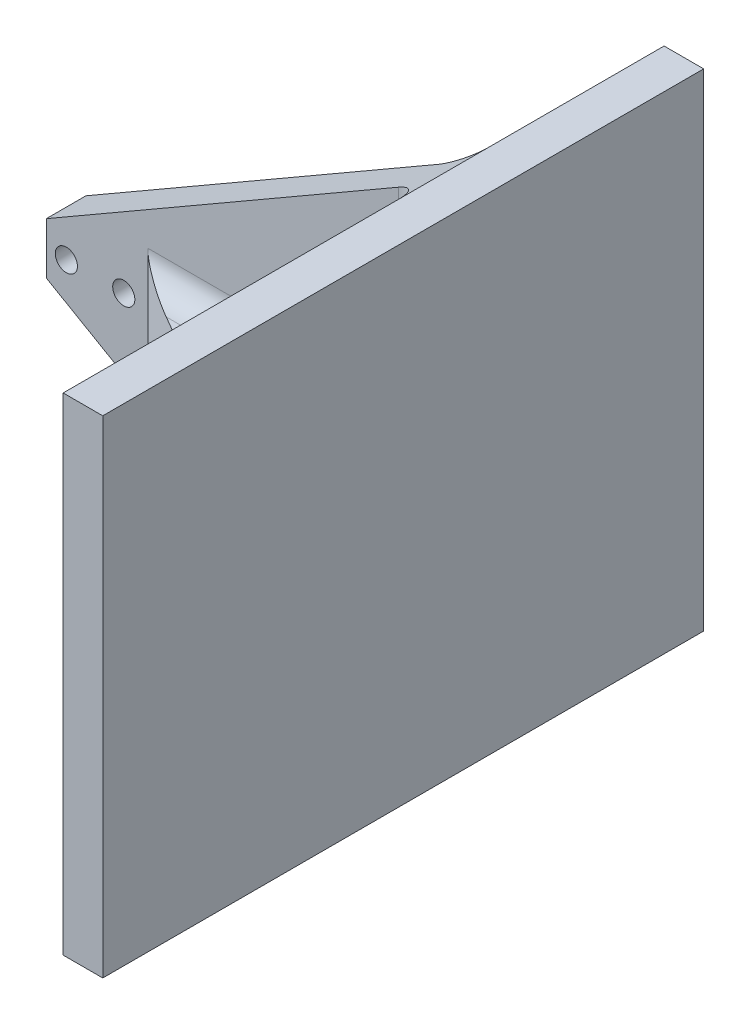
ISO-10303-21;
HEADER;
FILE_DESCRIPTION(('STEP AP214'),'2;1');
FILE_NAME('part.step','',(''),(''),'','','');
FILE_SCHEMA(('AUTOMOTIVE_DESIGN { 1 0 10303 214 1 1 1 1 }'));
ENDSEC;
DATA;
#1=APPLICATION_CONTEXT('core data for automotive mechanical design processes');
#2=APPLICATION_PROTOCOL_DEFINITION('international standard','automotive_design',2000,#1);
#3=PRODUCT_CONTEXT('',#1,'mechanical');
#4=PRODUCT('Part','Part','',(#3));
#5=PRODUCT_RELATED_PRODUCT_CATEGORY('part','',(#4));
#6=PRODUCT_DEFINITION_FORMATION('','',#4);
#7=PRODUCT_DEFINITION_CONTEXT('part definition',#1,'design');
#8=PRODUCT_DEFINITION('design','',#6,#7);
#9=PRODUCT_DEFINITION_SHAPE('','',#8);
#10=(LENGTH_UNIT() NAMED_UNIT(*) SI_UNIT(.MILLI.,.METRE.));
#11=(NAMED_UNIT(*) PLANE_ANGLE_UNIT() SI_UNIT($,.RADIAN.));
#12=(NAMED_UNIT(*) SI_UNIT($,.STERADIAN.) SOLID_ANGLE_UNIT());
#13=UNCERTAINTY_MEASURE_WITH_UNIT(LENGTH_MEASURE(1.E-05),#10,'distance_accuracy_value','');
#14=(GEOMETRIC_REPRESENTATION_CONTEXT(3) GLOBAL_UNCERTAINTY_ASSIGNED_CONTEXT((#13)) GLOBAL_UNIT_ASSIGNED_CONTEXT((#10,
#11,#12)) REPRESENTATION_CONTEXT('',''));
#15=CARTESIAN_POINT('',(0.,0.,0.));
#16=DIRECTION('',(0.,0.,1.));
#17=DIRECTION('',(1.,0.,0.));
#18=AXIS2_PLACEMENT_3D('',#15,#16,#17);
#19=CARTESIAN_POINT('',(0.,0.,0.));
#20=DIRECTION('',(0.,0.,-1.));
#21=DIRECTION('',(-1.,0.,0.));
#22=AXIS2_PLACEMENT_3D('',#19,#20,#21);
#23=PLANE('',#22);
#24=DIRECTION('',(0.866025403784436,-0.500000000000004,0.));
#25=VECTOR('',#24,1.);
#26=CARTESIAN_POINT('',(-24.634,0.,0.));
#27=LINE('',#26,#25);
#28=CARTESIAN_POINT('',(-24.634,0.,0.));
#29=VERTEX_POINT('',#28);
#30=CARTESIAN_POINT('',(64.266,-51.3264389309583,0.));
#31=VERTEX_POINT('',#30);
#32=EDGE_CURVE('E213',#29,#31,#27,.T.);
#33=ORIENTED_EDGE('',*,*,#32,.F.);
#34=DIRECTION('',(1.,0.,0.));
#35=VECTOR('',#34,1.);
#36=CARTESIAN_POINT('',(0.,0.,0.));
#37=LINE('',#36,#35);
#38=CARTESIAN_POINT('',(0.,0.,0.));
#39=VERTEX_POINT('',#38);
#40=EDGE_CURVE('E11',#29,#39,#37,.T.);
#41=ORIENTED_EDGE('',*,*,#40,.T.);
#42=DIRECTION('',(0.,1.,0.));
#43=VECTOR('',#42,1.);
#44=CARTESIAN_POINT('',(0.,0.,0.));
#45=LINE('',#44,#43);
#46=CARTESIAN_POINT('',(0.,13.,0.));
#47=VERTEX_POINT('',#46);
#48=EDGE_CURVE('E52',#39,#47,#45,.T.);
#49=ORIENTED_EDGE('',*,*,#48,.T.);
#50=DIRECTION('',(-1.,0.,0.));
#51=VECTOR('',#50,1.);
#52=CARTESIAN_POINT('',(0.,13.,0.));
#53=LINE('',#52,#51);
#54=CARTESIAN_POINT('',(-24.634,13.,0.));
#55=VERTEX_POINT('',#54);
#56=EDGE_CURVE('E291',#47,#55,#53,.T.);
#57=ORIENTED_EDGE('',*,*,#56,.T.);
#58=DIRECTION('',(-0.866025403784436,-0.500000000000004,0.));
#59=VECTOR('',#58,1.);
#60=CARTESIAN_POINT('',(70.616,67.9926131403125,0.));
#61=LINE('',#60,#59);
#62=CARTESIAN_POINT('',(64.266,64.3264389309583,0.));
#63=VERTEX_POINT('',#62);
#64=EDGE_CURVE('E209',#63,#55,#61,.T.);
#65=ORIENTED_EDGE('',*,*,#64,.F.);
#66=DIRECTION('',(0.,1.,0.));
#67=VECTOR('',#66,1.);
#68=CARTESIAN_POINT('',(64.266,0.,0.));
#69=LINE('',#68,#67);
#70=EDGE_CURVE('E256',#63,#31,#69,.F.);
#71=ORIENTED_EDGE('',*,*,#70,.T.);
#72=EDGE_LOOP('',(#33,#41,#49,#57,#65,#71));
#73=FACE_BOUND('',#72,.T.);
#74=ADVANCED_FACE('F43',(#73),#23,.T.);
#75=CARTESIAN_POINT('',(0.,0.,10.));
#76=DIRECTION('',(0.,0.,-1.));
#77=DIRECTION('',(-1.,0.,0.));
#78=AXIS2_PLACEMENT_3D('',#75,#76,#77);
#79=PLANE('',#78);
#80=CARTESIAN_POINT('',(-5.067,6.5,9.99999999999999));
#81=DIRECTION('',(0.,0.,-1.));
#82=DIRECTION('',(-1.,0.,0.));
#83=AXIS2_PLACEMENT_3D('',#80,#81,#82);
#84=CIRCLE('',#83,2.8);
#85=CARTESIAN_POINT('',(-7.867,6.5,9.99999999999999));
#86=VERTEX_POINT('',#85);
#87=EDGE_CURVE('E414',#86,#86,#84,.T.);
#88=ORIENTED_EDGE('',*,*,#87,.T.);
#89=EDGE_LOOP('',(#88));
#90=FACE_BOUND('',#89,.T.);
#91=CARTESIAN_POINT('',(-19.567,6.49999999999999,9.99999999999999));
#92=DIRECTION('',(0.,0.,-1.));
#93=DIRECTION('',(-1.,0.,0.));
#94=AXIS2_PLACEMENT_3D('',#91,#92,#93);
#95=CIRCLE('',#94,2.80000000000001);
#96=CARTESIAN_POINT('',(-22.367,6.49999999999999,9.99999999999999));
#97=VERTEX_POINT('',#96);
#98=EDGE_CURVE('E419',#97,#97,#95,.T.);
#99=ORIENTED_EDGE('',*,*,#98,.T.);
#100=EDGE_LOOP('',(#99));
#101=FACE_BOUND('',#100,.T.);
#102=DIRECTION('',(0.,1.,0.));
#103=VECTOR('',#102,1.);
#104=CARTESIAN_POINT('',(1.,-80.3856326798102,10.));
#105=LINE('',#104,#103);
#106=CARTESIAN_POINT('',(1.,-6.35,10.));
#107=VERTEX_POINT('',#106);
#108=CARTESIAN_POINT('',(1.,19.35,10.));
#109=VERTEX_POINT('',#108);
#110=EDGE_CURVE('E199',#107,#109,#105,.T.);
#111=ORIENTED_EDGE('',*,*,#110,.T.);
#112=DIRECTION('',(-1.,0.,0.));
#113=VECTOR('',#112,1.);
#114=CARTESIAN_POINT('',(0.,19.35,10.));
#115=LINE('',#114,#113);
#116=CARTESIAN_POINT('',(64.266,19.35,10.));
#117=VERTEX_POINT('',#116);
#118=EDGE_CURVE('E247',#109,#117,#115,.F.);
#119=ORIENTED_EDGE('',*,*,#118,.T.);
#120=DIRECTION('',(0.,1.,0.));
#121=VECTOR('',#120,1.);
#122=CARTESIAN_POINT('',(64.266,67.9926131403125,10.));
#123=LINE('',#122,#121);
#124=CARTESIAN_POINT('',(64.266,64.3264389309583,10.));
#125=VERTEX_POINT('',#124);
#126=EDGE_CURVE('E245',#117,#125,#123,.T.);
#127=ORIENTED_EDGE('',*,*,#126,.T.);
#128=DIRECTION('',(-0.866025403784436,-0.500000000000004,0.));
#129=VECTOR('',#128,1.);
#130=CARTESIAN_POINT('',(70.616,67.9926131403125,10.));
#131=LINE('',#130,#129);
#132=CARTESIAN_POINT('',(-24.634,13.,10.));
#133=VERTEX_POINT('',#132);
#134=EDGE_CURVE('E210',#125,#133,#131,.T.);
#135=ORIENTED_EDGE('',*,*,#134,.T.);
#136=DIRECTION('',(0.,-1.,0.));
#137=VECTOR('',#136,1.);
#138=CARTESIAN_POINT('',(-24.634,0.,10.));
#139=LINE('',#138,#137);
#140=CARTESIAN_POINT('',(-24.634,0.,10.));
#141=VERTEX_POINT('',#140);
#142=EDGE_CURVE('E212',#133,#141,#139,.T.);
#143=ORIENTED_EDGE('',*,*,#142,.T.);
#144=DIRECTION('',(0.866025403784436,-0.500000000000004,0.));
#145=VECTOR('',#144,1.);
#146=CARTESIAN_POINT('',(-24.634,0.,10.));
#147=LINE('',#146,#145);
#148=CARTESIAN_POINT('',(64.266,-51.3264389309583,10.));
#149=VERTEX_POINT('',#148);
#150=EDGE_CURVE('E215',#141,#149,#147,.T.);
#151=ORIENTED_EDGE('',*,*,#150,.T.);
#152=DIRECTION('',(0.,1.,0.));
#153=VECTOR('',#152,1.);
#154=CARTESIAN_POINT('',(64.266,0.,10.));
#155=LINE('',#154,#153);
#156=CARTESIAN_POINT('',(64.266,-6.35,10.));
#157=VERTEX_POINT('',#156);
#158=EDGE_CURVE('E240',#149,#157,#155,.T.);
#159=ORIENTED_EDGE('',*,*,#158,.T.);
#160=DIRECTION('',(1.,0.,0.));
#161=VECTOR('',#160,1.);
#162=CARTESIAN_POINT('',(1.,-6.35,10.));
#163=LINE('',#162,#161);
#164=EDGE_CURVE('E242',#157,#107,#163,.F.);
#165=ORIENTED_EDGE('',*,*,#164,.T.);
#166=EDGE_LOOP('',(#111,#119,#127,#135,#143,#151,#159,#165));
#167=FACE_BOUND('',#166,.T.);
#168=ADVANCED_FACE('F341',(#90,#101,#167),#79,.F.);
#169=CARTESIAN_POINT('',(70.616,67.9926131403125,10.));
#170=DIRECTION('',(0.500000000000004,-0.866025403784436,0.));
#171=DIRECTION('',(0.866025403784436,0.500000000000004,0.));
#172=AXIS2_PLACEMENT_3D('',#169,#170,#171);
#173=PLANE('',#172);
#174=DIRECTION('',(0.,0.,-1.));
#175=VECTOR('',#174,1.);
#176=CARTESIAN_POINT('',(70.616,67.9926131403125,10.));
#177=LINE('',#176,#175);
#178=CARTESIAN_POINT('',(70.616,67.9926131403125,16.35));
#179=VERTEX_POINT('',#178);
#180=CARTESIAN_POINT('',(70.616,67.9926131403125,-6.35));
#181=VERTEX_POINT('',#180);
#182=EDGE_CURVE('E218',#179,#181,#177,.T.);
#183=ORIENTED_EDGE('',*,*,#182,.T.);
#184=CARTESIAN_POINT('',(64.266,64.3264389309583,-6.35));
#185=DIRECTION('',(0.500000000000004,-0.866025403784436,0.));
#186=DIRECTION('',(0.866025403784436,0.500000000000004,0.));
#187=AXIS2_PLACEMENT_3D('',#184,#185,#186);
#188=ELLIPSE('',#187,7.33234841870827,6.35);
#189=EDGE_CURVE('E276',#181,#63,#188,.T.);
#190=ORIENTED_EDGE('',*,*,#189,.T.);
#191=ORIENTED_EDGE('',*,*,#64,.T.);
#192=DIRECTION('',(0.,0.,-1.));
#193=VECTOR('',#192,1.);
#194=CARTESIAN_POINT('',(-24.634,13.,10.));
#195=LINE('',#194,#193);
#196=EDGE_CURVE('E232',#133,#55,#195,.T.);
#197=ORIENTED_EDGE('',*,*,#196,.F.);
#198=ORIENTED_EDGE('',*,*,#134,.F.);
#199=CARTESIAN_POINT('',(64.266,64.3264389309583,16.35));
#200=DIRECTION('',(0.500000000000004,-0.866025403784436,0.));
#201=DIRECTION('',(-0.866025403784436,-0.500000000000004,0.));
#202=AXIS2_PLACEMENT_3D('',#199,#200,#201);
#203=ELLIPSE('',#202,7.33234841870827,6.35);
#204=EDGE_CURVE('E281',#125,#179,#203,.T.);
#205=ORIENTED_EDGE('',*,*,#204,.T.);
#206=EDGE_LOOP('',(#183,#190,#191,#197,#198,#205));
#207=FACE_BOUND('',#206,.T.);
#208=ADVANCED_FACE('F330',(#207),#173,.F.);
#209=CARTESIAN_POINT('',(-24.634,0.,10.));
#210=DIRECTION('',(1.,0.,0.));
#211=DIRECTION('',(0.,0.,-1.));
#212=AXIS2_PLACEMENT_3D('',#209,#210,#211);
#213=PLANE('',#212);
#214=DIRECTION('',(0.,-1.,0.));
#215=VECTOR('',#214,1.);
#216=CARTESIAN_POINT('',(-24.634,0.,0.));
#217=LINE('',#216,#215);
#218=EDGE_CURVE('E221',#55,#29,#217,.T.);
#219=ORIENTED_EDGE('',*,*,#218,.T.);
#220=DIRECTION('',(0.,0.,-1.));
#221=VECTOR('',#220,1.);
#222=CARTESIAN_POINT('',(-24.634,0.,10.));
#223=LINE('',#222,#221);
#224=EDGE_CURVE('E229',#141,#29,#223,.T.);
#225=ORIENTED_EDGE('',*,*,#224,.F.);
#226=ORIENTED_EDGE('',*,*,#142,.F.);
#227=ORIENTED_EDGE('',*,*,#196,.T.);
#228=EDGE_LOOP('',(#219,#225,#226,#227));
#229=FACE_BOUND('',#228,.T.);
#230=ADVANCED_FACE('F338',(#229),#213,.F.);
#231=CARTESIAN_POINT('',(-24.634,0.,10.));
#232=DIRECTION('',(0.500000000000004,0.866025403784436,0.));
#233=DIRECTION('',(-0.866025403784436,0.500000000000004,0.));
#234=AXIS2_PLACEMENT_3D('',#231,#232,#233);
#235=PLANE('',#234);
#236=ORIENTED_EDGE('',*,*,#32,.T.);
#237=CARTESIAN_POINT('',(64.266,-51.3264389309583,-6.35));
#238=DIRECTION('',(0.500000000000004,0.866025403784436,0.));
#239=DIRECTION('',(-0.866025403784436,0.500000000000004,0.));
#240=AXIS2_PLACEMENT_3D('',#237,#238,#239);
#241=ELLIPSE('',#240,7.33234841870827,6.35);
#242=CARTESIAN_POINT('',(70.616,-54.9926131403125,-6.34999999999999));
#243=VERTEX_POINT('',#242);
#244=EDGE_CURVE('E278',#31,#243,#241,.T.);
#245=ORIENTED_EDGE('',*,*,#244,.T.);
#246=DIRECTION('',(0.,0.,-1.));
#247=VECTOR('',#246,1.);
#248=CARTESIAN_POINT('',(70.616,-54.9926131403125,10.));
#249=LINE('',#248,#247);
#250=CARTESIAN_POINT('',(70.616,-54.9926131403125,16.35));
#251=VERTEX_POINT('',#250);
#252=EDGE_CURVE('E227',#251,#243,#249,.T.);
#253=ORIENTED_EDGE('',*,*,#252,.F.);
#254=CARTESIAN_POINT('',(64.266,-51.3264389309583,16.35));
#255=DIRECTION('',(0.500000000000004,0.866025403784436,0.));
#256=DIRECTION('',(0.866025403784436,-0.500000000000004,0.));
#257=AXIS2_PLACEMENT_3D('',#254,#255,#256);
#258=ELLIPSE('',#257,7.33234841870827,6.35);
#259=EDGE_CURVE('E289',#251,#149,#258,.T.);
#260=ORIENTED_EDGE('',*,*,#259,.T.);
#261=ORIENTED_EDGE('',*,*,#150,.F.);
#262=ORIENTED_EDGE('',*,*,#224,.T.);
#263=EDGE_LOOP('',(#236,#245,#253,#260,#261,#262));
#264=FACE_BOUND('',#263,.T.);
#265=ADVANCED_FACE('F380',(#264),#235,.F.);
#266=ORIENTED_EDGE('',*,*,#40,.F.);
#267=ORIENTED_EDGE('',*,*,#218,.F.);
#268=ORIENTED_EDGE('',*,*,#56,.F.);
#269=ORIENTED_EDGE('',*,*,#48,.F.);
#270=EDGE_LOOP('',(#266,#267,#268,#269));
#271=FACE_BOUND('',#270,.T.);
#272=CARTESIAN_POINT('',(-5.067,6.5,0.));
#273=DIRECTION('',(0.,0.,-1.));
#274=DIRECTION('',(-1.,0.,0.));
#275=AXIS2_PLACEMENT_3D('',#272,#273,#274);
#276=CIRCLE('',#275,2.8);
#277=CARTESIAN_POINT('',(-7.867,6.5,0.));
#278=VERTEX_POINT('',#277);
#279=EDGE_CURVE('E422',#278,#278,#276,.T.);
#280=ORIENTED_EDGE('',*,*,#279,.F.);
#281=EDGE_LOOP('',(#280));
#282=FACE_BOUND('',#281,.T.);
#283=CARTESIAN_POINT('',(-19.567,6.49999999999999,0.));
#284=DIRECTION('',(0.,0.,-1.));
#285=DIRECTION('',(-1.,0.,0.));
#286=AXIS2_PLACEMENT_3D('',#283,#284,#285);
#287=CIRCLE('',#286,2.80000000000001);
#288=CARTESIAN_POINT('',(-22.367,6.49999999999999,0.));
#289=VERTEX_POINT('',#288);
#290=EDGE_CURVE('E315',#289,#289,#287,.T.);
#291=ORIENTED_EDGE('',*,*,#290,.F.);
#292=EDGE_LOOP('',(#291));
#293=FACE_BOUND('',#292,.T.);
#294=ADVANCED_FACE('F333',(#271,#282,#293),#23,.T.);
#295=CARTESIAN_POINT('',(1.,-80.3856326798102,10.));
#296=DIRECTION('',(-0.500000000000004,0.,0.866025403784436));
#297=DIRECTION('',(0.866025403784436,0.,0.500000000000004));
#298=AXIS2_PLACEMENT_3D('',#295,#296,#297);
#299=PLANE('',#298);
#300=DIRECTION('',(-0.866025403784436,0.,-0.500000000000004));
#301=VECTOR('',#300,1.);
#302=CARTESIAN_POINT('',(1.,0.,10.));
#303=LINE('',#302,#301);
#304=CARTESIAN_POINT('',(64.266,0.,46.5266421305513));
#305=VERTEX_POINT('',#304);
#306=CARTESIAN_POINT('',(11.9985226280622,0.,16.35));
#307=VERTEX_POINT('',#306);
#308=EDGE_CURVE('E206',#305,#307,#303,.T.);
#309=ORIENTED_EDGE('',*,*,#308,.F.);
#310=CARTESIAN_POINT('',(64.266,-6.35,46.5266421305513));
#311=DIRECTION('',(-0.500000000000004,0.,0.866025403784436));
#312=DIRECTION('',(-0.866025403784436,0.,-0.500000000000004));
#313=AXIS2_PLACEMENT_3D('',#310,#311,#312);
#314=ELLIPSE('',#313,7.33234841870827,6.35);
#315=CARTESIAN_POINT('',(67.441,-0.850738685968519,48.3597292352284));
#316=VERTEX_POINT('',#315);
#317=EDGE_CURVE('E286',#305,#316,#314,.F.);
#318=ORIENTED_EDGE('',*,*,#317,.T.);
#319=DIRECTION('',(0.,1.,0.));
#320=VECTOR('',#319,1.);
#321=CARTESIAN_POINT('',(67.441,-80.3856326798102,48.3597292352284));
#322=LINE('',#321,#320);
#323=CARTESIAN_POINT('',(67.441,13.8507386859685,48.3597292352284));
#324=VERTEX_POINT('',#323);
#325=EDGE_CURVE('E269',#316,#324,#322,.T.);
#326=ORIENTED_EDGE('',*,*,#325,.T.);
#327=CARTESIAN_POINT('',(64.266,19.35,46.5266421305513));
#328=DIRECTION('',(-0.500000000000004,0.,0.866025403784436));
#329=DIRECTION('',(-0.866025403784436,0.,-0.500000000000004));
#330=AXIS2_PLACEMENT_3D('',#327,#328,#329);
#331=ELLIPSE('',#330,7.33234841870827,6.35);
#332=CARTESIAN_POINT('',(64.266,13.,46.5266421305513));
#333=VERTEX_POINT('',#332);
#334=EDGE_CURVE('E284',#324,#333,#331,.F.);
#335=ORIENTED_EDGE('',*,*,#334,.T.);
#336=DIRECTION('',(0.866025403784436,0.,0.500000000000004));
#337=VECTOR('',#336,1.);
#338=CARTESIAN_POINT('',(1.,13.,10.));
#339=LINE('',#338,#337);
#340=CARTESIAN_POINT('',(11.9985226280622,13.,16.35));
#341=VERTEX_POINT('',#340);
#342=EDGE_CURVE('E196',#341,#333,#339,.T.);
#343=ORIENTED_EDGE('',*,*,#342,.F.);
#344=CARTESIAN_POINT('',(11.9985226280622,19.35,16.35));
#345=DIRECTION('',(-0.500000000000004,0.,0.866025403784436));
#346=DIRECTION('',(-0.866025403784436,0.,-0.500000000000004));
#347=AXIS2_PLACEMENT_3D('',#344,#345,#346);
#348=ELLIPSE('',#347,12.6999999999999,6.35);
#349=EDGE_CURVE('E273',#341,#109,#348,.F.);
#350=ORIENTED_EDGE('',*,*,#349,.T.);
#351=ORIENTED_EDGE('',*,*,#110,.F.);
#352=CARTESIAN_POINT('',(11.9985226280622,-6.35,16.35));
#353=DIRECTION('',(-0.500000000000004,0.,0.866025403784436));
#354=DIRECTION('',(-0.866025403784436,0.,-0.500000000000004));
#355=AXIS2_PLACEMENT_3D('',#352,#353,#354);
#356=ELLIPSE('',#355,12.6999999999999,6.35);
#357=EDGE_CURVE('E271',#107,#307,#356,.F.);
#358=ORIENTED_EDGE('',*,*,#357,.T.);
#359=EDGE_LOOP('',(#309,#318,#326,#335,#343,#350,#351,#358));
#360=FACE_BOUND('',#359,.T.);
#361=ADVANCED_FACE('F395',(#360),#299,.T.);
#362=CARTESIAN_POINT('',(0.,13.,0.));
#363=DIRECTION('',(0.,1.,0.));
#364=DIRECTION('',(0.,0.,1.));
#365=AXIS2_PLACEMENT_3D('',#362,#363,#364);
#366=PLANE('',#365);
#367=DIRECTION('',(0.,0.,-1.));
#368=VECTOR('',#367,1.);
#369=CARTESIAN_POINT('',(64.266,13.,0.));
#370=LINE('',#369,#368);
#371=CARTESIAN_POINT('',(64.266,13.,16.35));
#372=VERTEX_POINT('',#371);
#373=EDGE_CURVE('E249',#333,#372,#370,.T.);
#374=ORIENTED_EDGE('',*,*,#373,.T.);
#375=DIRECTION('',(-1.,0.,0.));
#376=VECTOR('',#375,1.);
#377=CARTESIAN_POINT('',(0.,13.,16.35));
#378=LINE('',#377,#376);
#379=EDGE_CURVE('E251',#372,#341,#378,.T.);
#380=ORIENTED_EDGE('',*,*,#379,.T.);
#381=ORIENTED_EDGE('',*,*,#342,.T.);
#382=EDGE_LOOP('',(#374,#380,#381));
#383=FACE_BOUND('',#382,.T.);
#384=ADVANCED_FACE('F486',(#383),#366,.T.);
#385=CARTESIAN_POINT('',(0.,0.,-13.));
#386=DIRECTION('',(0.,1.,0.));
#387=DIRECTION('',(1.,0.,0.));
#388=AXIS2_PLACEMENT_3D('',#385,#386,#387);
#389=PLANE('',#388);
#390=ORIENTED_EDGE('',*,*,#308,.T.);
#391=DIRECTION('',(1.,0.,0.));
#392=VECTOR('',#391,1.);
#393=CARTESIAN_POINT('',(70.616,0.,16.35));
#394=LINE('',#393,#392);
#395=CARTESIAN_POINT('',(64.266,0.,16.35));
#396=VERTEX_POINT('',#395);
#397=EDGE_CURVE('E237',#307,#396,#394,.T.);
#398=ORIENTED_EDGE('',*,*,#397,.T.);
#399=DIRECTION('',(0.,0.,1.));
#400=VECTOR('',#399,1.);
#401=CARTESIAN_POINT('',(64.266,0.,50.1928163399054));
#402=LINE('',#401,#400);
#403=EDGE_CURVE('E235',#396,#305,#402,.T.);
#404=ORIENTED_EDGE('',*,*,#403,.T.);
#405=EDGE_LOOP('',(#390,#398,#404));
#406=FACE_BOUND('',#405,.T.);
#407=ADVANCED_FACE('F398',(#406),#389,.F.);
#408=CARTESIAN_POINT('',(70.616,0.,0.));
#409=DIRECTION('',(1.,0.,0.));
#410=DIRECTION('',(0.,1.,0.));
#411=AXIS2_PLACEMENT_3D('',#408,#409,#410);
#412=PLANE('',#411);
#413=DIRECTION('',(0.,0.,-1.));
#414=VECTOR('',#413,1.);
#415=CARTESIAN_POINT('',(70.616,-54.9926131403125,100.992816339905));
#416=LINE('',#415,#414);
#417=CARTESIAN_POINT('',(70.616,-54.9926131403125,-50.8));
#418=VERTEX_POINT('',#417);
#419=EDGE_CURVE('E376',#243,#418,#416,.T.);
#420=ORIENTED_EDGE('',*,*,#419,.F.);
#421=DIRECTION('',(0.,1.,0.));
#422=VECTOR('',#421,1.);
#423=CARTESIAN_POINT('',(70.616,0.,-6.35));
#424=LINE('',#423,#422);
#425=EDGE_CURVE('E253',#243,#181,#424,.T.);
#426=ORIENTED_EDGE('',*,*,#425,.T.);
#427=DIRECTION('',(0.,0.,1.));
#428=VECTOR('',#427,1.);
#429=CARTESIAN_POINT('',(70.616,67.9926131403125,100.992816339905));
#430=LINE('',#429,#428);
#431=CARTESIAN_POINT('',(70.616,67.9926131403125,-50.8));
#432=VERTEX_POINT('',#431);
#433=EDGE_CURVE('E191',#432,#181,#430,.T.);
#434=ORIENTED_EDGE('',*,*,#433,.F.);
#435=DIRECTION('',(0.,1.,0.));
#436=VECTOR('',#435,1.);
#437=CARTESIAN_POINT('',(70.616,67.9926131403125,-50.8));
#438=LINE('',#437,#436);
#439=EDGE_CURVE('E358',#418,#432,#438,.T.);
#440=ORIENTED_EDGE('',*,*,#439,.F.);
#441=EDGE_LOOP('',(#420,#426,#434,#440));
#442=FACE_BOUND('',#441,.T.);
#443=ADVANCED_FACE('F374',(#442),#412,.F.);
#444=CARTESIAN_POINT('',(80.616,67.9926131403125,100.992816339905));
#445=DIRECTION('',(0.,0.,-1.));
#446=DIRECTION('',(0.,1.,0.));
#447=AXIS2_PLACEMENT_3D('',#444,#445,#446);
#448=PLANE('',#447);
#449=DIRECTION('',(0.,-1.,0.));
#450=VECTOR('',#449,1.);
#451=CARTESIAN_POINT('',(70.616,67.9926131403125,100.992816339905));
#452=LINE('',#451,#450);
#453=CARTESIAN_POINT('',(70.616,67.9926131403125,100.992816339905));
#454=VERTEX_POINT('',#453);
#455=CARTESIAN_POINT('',(70.616,-54.9926131403125,100.992816339905));
#456=VERTEX_POINT('',#455);
#457=EDGE_CURVE('E195',#454,#456,#452,.T.);
#458=ORIENTED_EDGE('',*,*,#457,.T.);
#459=DIRECTION('',(-1.,0.,0.));
#460=VECTOR('',#459,1.);
#461=CARTESIAN_POINT('',(80.616,-54.9926131403125,100.992816339905));
#462=LINE('',#461,#460);
#463=CARTESIAN_POINT('',(80.616,-54.9926131403125,100.992816339905));
#464=VERTEX_POINT('',#463);
#465=EDGE_CURVE('E175',#464,#456,#462,.T.);
#466=ORIENTED_EDGE('',*,*,#465,.F.);
#467=DIRECTION('',(0.,-1.,0.));
#468=VECTOR('',#467,1.);
#469=CARTESIAN_POINT('',(80.616,67.9926131403125,100.992816339905));
#470=LINE('',#469,#468);
#471=CARTESIAN_POINT('',(80.616,67.9926131403125,100.992816339905));
#472=VERTEX_POINT('',#471);
#473=EDGE_CURVE('E182',#472,#464,#470,.T.);
#474=ORIENTED_EDGE('',*,*,#473,.F.);
#475=DIRECTION('',(-1.,0.,0.));
#476=VECTOR('',#475,1.);
#477=CARTESIAN_POINT('',(80.616,67.9926131403125,100.992816339905));
#478=LINE('',#477,#476);
#479=EDGE_CURVE('E365',#472,#454,#478,.T.);
#480=ORIENTED_EDGE('',*,*,#479,.T.);
#481=EDGE_LOOP('',(#458,#466,#474,#480));
#482=FACE_BOUND('',#481,.T.);
#483=ADVANCED_FACE('F193',(#482),#448,.F.);
#484=CARTESIAN_POINT('',(80.616,-54.9926131403125,100.992816339905));
#485=DIRECTION('',(0.,1.,0.));
#486=DIRECTION('',(-1.,0.,0.));
#487=AXIS2_PLACEMENT_3D('',#484,#485,#486);
#488=PLANE('',#487);
#489=EDGE_CURVE('E361',#456,#251,#416,.T.);
#490=ORIENTED_EDGE('',*,*,#489,.T.);
#491=ORIENTED_EDGE('',*,*,#252,.T.);
#492=ORIENTED_EDGE('',*,*,#419,.T.);
#493=DIRECTION('',(-1.,0.,0.));
#494=VECTOR('',#493,1.);
#495=CARTESIAN_POINT('',(80.616,-54.9926131403125,-50.8));
#496=LINE('',#495,#494);
#497=CARTESIAN_POINT('',(80.616,-54.9926131403125,-50.8));
#498=VERTEX_POINT('',#497);
#499=EDGE_CURVE('E178',#498,#418,#496,.T.);
#500=ORIENTED_EDGE('',*,*,#499,.F.);
#501=DIRECTION('',(0.,0.,-1.));
#502=VECTOR('',#501,1.);
#503=CARTESIAN_POINT('',(80.616,-54.9926131403125,100.992816339905));
#504=LINE('',#503,#502);
#505=EDGE_CURVE('E170',#464,#498,#504,.T.);
#506=ORIENTED_EDGE('',*,*,#505,.F.);
#507=ORIENTED_EDGE('',*,*,#465,.T.);
#508=EDGE_LOOP('',(#490,#491,#492,#500,#506,#507));
#509=FACE_BOUND('',#508,.T.);
#510=ADVANCED_FACE('F173',(#509),#488,.F.);
#511=CARTESIAN_POINT('',(80.616,67.9926131403125,-50.8));
#512=DIRECTION('',(0.,0.,1.));
#513=DIRECTION('',(0.,-1.,0.));
#514=AXIS2_PLACEMENT_3D('',#511,#512,#513);
#515=PLANE('',#514);
#516=ORIENTED_EDGE('',*,*,#439,.T.);
#517=DIRECTION('',(-1.,0.,0.));
#518=VECTOR('',#517,1.);
#519=CARTESIAN_POINT('',(80.616,67.9926131403125,-50.8));
#520=LINE('',#519,#518);
#521=CARTESIAN_POINT('',(80.616,67.9926131403125,-50.8));
#522=VERTEX_POINT('',#521);
#523=EDGE_CURVE('E201',#522,#432,#520,.T.);
#524=ORIENTED_EDGE('',*,*,#523,.F.);
#525=DIRECTION('',(0.,1.,0.));
#526=VECTOR('',#525,1.);
#527=CARTESIAN_POINT('',(80.616,67.9926131403125,-50.8));
#528=LINE('',#527,#526);
#529=EDGE_CURVE('E181',#498,#522,#528,.T.);
#530=ORIENTED_EDGE('',*,*,#529,.F.);
#531=ORIENTED_EDGE('',*,*,#499,.T.);
#532=EDGE_LOOP('',(#516,#524,#530,#531));
#533=FACE_BOUND('',#532,.T.);
#534=ADVANCED_FACE('F498',(#533),#515,.F.);
#535=CARTESIAN_POINT('',(80.616,67.9926131403125,100.992816339905));
#536=DIRECTION('',(0.,-1.,0.));
#537=DIRECTION('',(1.,0.,0.));
#538=AXIS2_PLACEMENT_3D('',#535,#536,#537);
#539=PLANE('',#538);
#540=ORIENTED_EDGE('',*,*,#433,.T.);
#541=ORIENTED_EDGE('',*,*,#182,.F.);
#542=EDGE_CURVE('E356',#179,#454,#430,.T.);
#543=ORIENTED_EDGE('',*,*,#542,.T.);
#544=ORIENTED_EDGE('',*,*,#479,.F.);
#545=DIRECTION('',(0.,0.,1.));
#546=VECTOR('',#545,1.);
#547=CARTESIAN_POINT('',(80.616,67.9926131403125,100.992816339905));
#548=LINE('',#547,#546);
#549=EDGE_CURVE('E187',#522,#472,#548,.T.);
#550=ORIENTED_EDGE('',*,*,#549,.F.);
#551=ORIENTED_EDGE('',*,*,#523,.T.);
#552=EDGE_LOOP('',(#540,#541,#543,#544,#550,#551));
#553=FACE_BOUND('',#552,.T.);
#554=ADVANCED_FACE('F369',(#553),#539,.F.);
#555=CARTESIAN_POINT('',(80.616,0.,0.));
#556=DIRECTION('',(1.,0.,0.));
#557=DIRECTION('',(0.,1.,0.));
#558=AXIS2_PLACEMENT_3D('',#555,#556,#557);
#559=PLANE('',#558);
#560=ORIENTED_EDGE('',*,*,#473,.T.);
#561=ORIENTED_EDGE('',*,*,#505,.T.);
#562=ORIENTED_EDGE('',*,*,#529,.T.);
#563=ORIENTED_EDGE('',*,*,#549,.T.);
#564=EDGE_LOOP('',(#560,#561,#562,#563));
#565=FACE_BOUND('',#564,.T.);
#566=ADVANCED_FACE('F185',(#565),#559,.T.);
#567=ORIENTED_EDGE('',*,*,#542,.F.);
#568=DIRECTION('',(0.,1.,0.));
#569=VECTOR('',#568,1.);
#570=CARTESIAN_POINT('',(70.616,13.,16.35));
#571=LINE('',#570,#569);
#572=CARTESIAN_POINT('',(70.616,19.35,16.35));
#573=VERTEX_POINT('',#572);
#574=EDGE_CURVE('E267',#179,#573,#571,.F.);
#575=ORIENTED_EDGE('',*,*,#574,.T.);
#576=DIRECTION('',(0.,0.,-1.));
#577=VECTOR('',#576,1.);
#578=CARTESIAN_POINT('',(70.616,19.35,0.));
#579=LINE('',#578,#577);
#580=CARTESIAN_POINT('',(70.616,19.35,53.8589905492595));
#581=VERTEX_POINT('',#580);
#582=EDGE_CURVE('E265',#573,#581,#579,.F.);
#583=ORIENTED_EDGE('',*,*,#582,.T.);
#584=DIRECTION('',(0.,1.,0.));
#585=VECTOR('',#584,1.);
#586=CARTESIAN_POINT('',(70.616,0.,53.8589905492595));
#587=LINE('',#586,#585);
#588=CARTESIAN_POINT('',(70.616,-6.35,53.8589905492595));
#589=VERTEX_POINT('',#588);
#590=EDGE_CURVE('E263',#581,#589,#587,.F.);
#591=ORIENTED_EDGE('',*,*,#590,.T.);
#592=DIRECTION('',(0.,0.,1.));
#593=VECTOR('',#592,1.);
#594=CARTESIAN_POINT('',(70.616,-6.35,10.));
#595=LINE('',#594,#593);
#596=CARTESIAN_POINT('',(70.616,-6.35,16.35));
#597=VERTEX_POINT('',#596);
#598=EDGE_CURVE('E261',#589,#597,#595,.F.);
#599=ORIENTED_EDGE('',*,*,#598,.T.);
#600=DIRECTION('',(0.,1.,0.));
#601=VECTOR('',#600,1.);
#602=CARTESIAN_POINT('',(70.616,-54.9926131403125,16.35));
#603=LINE('',#602,#601);
#604=EDGE_CURVE('E258',#597,#251,#603,.F.);
#605=ORIENTED_EDGE('',*,*,#604,.T.);
#606=ORIENTED_EDGE('',*,*,#489,.F.);
#607=ORIENTED_EDGE('',*,*,#457,.F.);
#608=EDGE_LOOP('',(#567,#575,#583,#591,#599,#605,#606,#607));
#609=FACE_BOUND('',#608,.T.);
#610=ADVANCED_FACE('F353',(#609),#412,.F.);
#611=CARTESIAN_POINT('',(-19.567,6.49999999999999,100.992816339905));
#612=DIRECTION('',(0.,0.,-1.));
#613=DIRECTION('',(-1.,0.,0.));
#614=AXIS2_PLACEMENT_3D('',#611,#612,#613);
#615=CYLINDRICAL_SURFACE('',#614,2.80000000000001);
#616=ORIENTED_EDGE('',*,*,#290,.T.);
#617=EDGE_LOOP('',(#616));
#618=FACE_BOUND('',#617,.T.);
#619=ORIENTED_EDGE('',*,*,#98,.F.);
#620=EDGE_LOOP('',(#619));
#621=FACE_BOUND('',#620,.T.);
#622=ADVANCED_FACE('F435',(#618,#621),#615,.F.);
#623=CARTESIAN_POINT('',(-5.067,6.5,100.992816339905));
#624=DIRECTION('',(0.,0.,-1.));
#625=DIRECTION('',(-1.,0.,0.));
#626=AXIS2_PLACEMENT_3D('',#623,#624,#625);
#627=CYLINDRICAL_SURFACE('',#626,2.8);
#628=ORIENTED_EDGE('',*,*,#279,.T.);
#629=EDGE_LOOP('',(#628));
#630=FACE_BOUND('',#629,.T.);
#631=ORIENTED_EDGE('',*,*,#87,.F.);
#632=EDGE_LOOP('',(#631));
#633=FACE_BOUND('',#632,.T.);
#634=ADVANCED_FACE('F428',(#630,#633),#627,.F.);
#635=CARTESIAN_POINT('',(0.,19.35,16.35));
#636=DIRECTION('',(-1.,0.,0.));
#637=DIRECTION('',(0.,0.,1.));
#638=AXIS2_PLACEMENT_3D('',#635,#636,#637);
#639=CYLINDRICAL_SURFACE('',#638,6.35);
#640=ORIENTED_EDGE('',*,*,#349,.F.);
#641=ORIENTED_EDGE('',*,*,#379,.F.);
#642=CARTESIAN_POINT('',(64.266,19.35,16.35));
#643=DIRECTION('',(-1.,0.,0.));
#644=DIRECTION('',(0.,-1.,0.));
#645=AXIS2_PLACEMENT_3D('',#642,#643,#644);
#646=CIRCLE('',#645,6.35);
#647=EDGE_CURVE('E312',#117,#372,#646,.T.);
#648=ORIENTED_EDGE('',*,*,#647,.F.);
#649=ORIENTED_EDGE('',*,*,#118,.F.);
#650=EDGE_LOOP('',(#640,#641,#648,#649));
#651=FACE_BOUND('',#650,.T.);
#652=ADVANCED_FACE('F475',(#651),#639,.F.);
#653=CARTESIAN_POINT('',(64.266,0.,16.35));
#654=DIRECTION('',(0.,-1.,0.));
#655=DIRECTION('',(1.,0.,0.));
#656=AXIS2_PLACEMENT_3D('',#653,#654,#655);
#657=CYLINDRICAL_SURFACE('',#656,6.35);
#658=ORIENTED_EDGE('',*,*,#204,.F.);
#659=ORIENTED_EDGE('',*,*,#126,.F.);
#660=CARTESIAN_POINT('',(64.266,19.35,16.35));
#661=DIRECTION('',(0.,1.,0.));
#662=DIRECTION('',(0.,0.,1.));
#663=AXIS2_PLACEMENT_3D('',#660,#661,#662);
#664=CIRCLE('',#663,6.35);
#665=EDGE_CURVE('E309',#573,#117,#664,.T.);
#666=ORIENTED_EDGE('',*,*,#665,.F.);
#667=ORIENTED_EDGE('',*,*,#574,.F.);
#668=EDGE_LOOP('',(#658,#659,#666,#667));
#669=FACE_BOUND('',#668,.T.);
#670=ADVANCED_FACE('F347',(#669),#657,.F.);
#671=CARTESIAN_POINT('',(64.266,19.35,16.35));
#672=DIRECTION('',(0.,0.,1.));
#673=DIRECTION('',(1.,0.,0.));
#674=AXIS2_PLACEMENT_3D('',#671,#672,#673);
#675=SPHERICAL_SURFACE('',#674,6.35);
#676=ORIENTED_EDGE('',*,*,#665,.T.);
#677=ORIENTED_EDGE('',*,*,#647,.T.);
#678=CARTESIAN_POINT('',(64.266,19.35,16.35));
#679=DIRECTION('',(0.,0.,1.));
#680=DIRECTION('',(1.,0.,0.));
#681=AXIS2_PLACEMENT_3D('',#678,#679,#680);
#682=CIRCLE('',#681,6.35);
#683=EDGE_CURVE('E306',#573,#372,#682,.F.);
#684=ORIENTED_EDGE('',*,*,#683,.F.);
#685=EDGE_LOOP('',(#676,#677,#684));
#686=FACE_BOUND('',#685,.T.);
#687=ADVANCED_FACE('F470',(#686),#675,.F.);
#688=CARTESIAN_POINT('',(64.266,19.35,0.));
#689=DIRECTION('',(0.,0.,-1.));
#690=DIRECTION('',(-1.,0.,0.));
#691=AXIS2_PLACEMENT_3D('',#688,#689,#690);
#692=CYLINDRICAL_SURFACE('',#691,6.35);
#693=ORIENTED_EDGE('',*,*,#373,.F.);
#694=ORIENTED_EDGE('',*,*,#334,.F.);
#695=CARTESIAN_POINT('',(64.266,19.35,53.8589905492595));
#696=DIRECTION('',(0.,0.707106781186547,-0.707106781186547));
#697=DIRECTION('',(0.,0.707106781186548,0.707106781186547));
#698=AXIS2_PLACEMENT_3D('',#695,#696,#697);
#699=ELLIPSE('',#698,8.98025612106915,6.35);
#700=EDGE_CURVE('E303',#581,#324,#699,.T.);
#701=ORIENTED_EDGE('',*,*,#700,.F.);
#702=ORIENTED_EDGE('',*,*,#582,.F.);
#703=ORIENTED_EDGE('',*,*,#683,.T.);
#704=EDGE_LOOP('',(#693,#694,#701,#702,#703));
#705=FACE_BOUND('',#704,.T.);
#706=ADVANCED_FACE('F409',(#705),#692,.F.);
#707=CARTESIAN_POINT('',(64.266,-80.3856326798102,53.8589905492595));
#708=DIRECTION('',(0.,1.,0.));
#709=DIRECTION('',(-1.,0.,0.));
#710=AXIS2_PLACEMENT_3D('',#707,#708,#709);
#711=CYLINDRICAL_SURFACE('',#710,6.35);
#712=ORIENTED_EDGE('',*,*,#325,.F.);
#713=CARTESIAN_POINT('',(64.266,-6.35,53.8589905492595));
#714=DIRECTION('',(0.,-0.707106781186548,-0.707106781186547));
#715=DIRECTION('',(0.,0.707106781186547,-0.707106781186547));
#716=AXIS2_PLACEMENT_3D('',#713,#714,#715);
#717=ELLIPSE('',#716,8.98025612106915,6.35);
#718=EDGE_CURVE('E300',#589,#316,#717,.F.);
#719=ORIENTED_EDGE('',*,*,#718,.F.);
#720=ORIENTED_EDGE('',*,*,#590,.F.);
#721=ORIENTED_EDGE('',*,*,#700,.T.);
#722=EDGE_LOOP('',(#712,#719,#720,#721));
#723=FACE_BOUND('',#722,.T.);
#724=ADVANCED_FACE('F411',(#723),#711,.F.);
#725=CARTESIAN_POINT('',(64.266,-6.35,-13.));
#726=DIRECTION('',(0.,0.,-1.));
#727=DIRECTION('',(-1.,0.,0.));
#728=AXIS2_PLACEMENT_3D('',#725,#726,#727);
#729=CYLINDRICAL_SURFACE('',#728,6.35);
#730=ORIENTED_EDGE('',*,*,#317,.F.);
#731=ORIENTED_EDGE('',*,*,#403,.F.);
#732=CARTESIAN_POINT('',(64.266,-6.35,16.35));
#733=DIRECTION('',(0.,0.,1.));
#734=DIRECTION('',(0.,-1.,0.));
#735=AXIS2_PLACEMENT_3D('',#732,#733,#734);
#736=CIRCLE('',#735,6.35);
#737=EDGE_CURVE('E297',#597,#396,#736,.T.);
#738=ORIENTED_EDGE('',*,*,#737,.F.);
#739=ORIENTED_EDGE('',*,*,#598,.F.);
#740=ORIENTED_EDGE('',*,*,#718,.T.);
#741=EDGE_LOOP('',(#730,#731,#738,#739,#740));
#742=FACE_BOUND('',#741,.T.);
#743=ADVANCED_FACE('F401',(#742),#729,.F.);
#744=CARTESIAN_POINT('',(64.266,0.,16.35));
#745=DIRECTION('',(0.,-1.,0.));
#746=DIRECTION('',(1.,0.,0.));
#747=AXIS2_PLACEMENT_3D('',#744,#745,#746);
#748=CYLINDRICAL_SURFACE('',#747,6.35);
#749=ORIENTED_EDGE('',*,*,#259,.F.);
#750=ORIENTED_EDGE('',*,*,#604,.F.);
#751=CARTESIAN_POINT('',(64.266,-6.35,16.35));
#752=DIRECTION('',(0.,-1.,0.));
#753=DIRECTION('',(1.,0.,0.));
#754=AXIS2_PLACEMENT_3D('',#751,#752,#753);
#755=CIRCLE('',#754,6.35);
#756=EDGE_CURVE('E294',#157,#597,#755,.T.);
#757=ORIENTED_EDGE('',*,*,#756,.F.);
#758=ORIENTED_EDGE('',*,*,#158,.F.);
#759=EDGE_LOOP('',(#749,#750,#757,#758));
#760=FACE_BOUND('',#759,.T.);
#761=ADVANCED_FACE('F384',(#760),#748,.F.);
#762=CARTESIAN_POINT('',(64.266,-6.35,16.35));
#763=DIRECTION('',(0.,0.,1.));
#764=DIRECTION('',(1.,0.,0.));
#765=AXIS2_PLACEMENT_3D('',#762,#763,#764);
#766=SPHERICAL_SURFACE('',#765,6.35);
#767=ORIENTED_EDGE('',*,*,#756,.T.);
#768=ORIENTED_EDGE('',*,*,#737,.T.);
#769=CARTESIAN_POINT('',(64.266,-6.35,16.35));
#770=DIRECTION('',(-1.,0.,0.));
#771=DIRECTION('',(0.,0.,1.));
#772=AXIS2_PLACEMENT_3D('',#769,#770,#771);
#773=CIRCLE('',#772,6.35);
#774=EDGE_CURVE('E292',#157,#396,#773,.F.);
#775=ORIENTED_EDGE('',*,*,#774,.F.);
#776=EDGE_LOOP('',(#767,#768,#775));
#777=FACE_BOUND('',#776,.T.);
#778=ADVANCED_FACE('F458',(#777),#766,.F.);
#779=CARTESIAN_POINT('',(0.,-6.35,16.35));
#780=DIRECTION('',(-1.,0.,0.));
#781=DIRECTION('',(0.,-1.,0.));
#782=AXIS2_PLACEMENT_3D('',#779,#780,#781);
#783=CYLINDRICAL_SURFACE('',#782,6.35);
#784=ORIENTED_EDGE('',*,*,#357,.F.);
#785=ORIENTED_EDGE('',*,*,#164,.F.);
#786=ORIENTED_EDGE('',*,*,#774,.T.);
#787=ORIENTED_EDGE('',*,*,#397,.F.);
#788=EDGE_LOOP('',(#784,#785,#786,#787));
#789=FACE_BOUND('',#788,.T.);
#790=ADVANCED_FACE('F392',(#789),#783,.F.);
#791=CARTESIAN_POINT('',(64.266,0.,-6.35));
#792=DIRECTION('',(0.,1.,0.));
#793=DIRECTION('',(-1.,0.,0.));
#794=AXIS2_PLACEMENT_3D('',#791,#792,#793);
#795=CYLINDRICAL_SURFACE('',#794,6.35);
#796=ORIENTED_EDGE('',*,*,#244,.F.);
#797=ORIENTED_EDGE('',*,*,#70,.F.);
#798=ORIENTED_EDGE('',*,*,#189,.F.);
#799=ORIENTED_EDGE('',*,*,#425,.F.);
#800=EDGE_LOOP('',(#796,#797,#798,#799));
#801=FACE_BOUND('',#800,.T.);
#802=ADVANCED_FACE('F45',(#801),#795,.F.);
#803=CLOSED_SHELL('',(#74,#168,#208,#230,#265,#294,#361,#384,#407,#443,#483,#510,#534,#554,#566,
#610,#622,#634,#652,#670,#687,#706,#724,#743,#761,#778,#790,#802));
#804=MANIFOLD_SOLID_BREP('B2',#803);
#805=ADVANCED_BREP_SHAPE_REPRESENTATION('',(#18,#804),#14);
#806=SHAPE_DEFINITION_REPRESENTATION(#9,#805);
ENDSEC;
END-ISO-10303-21;
